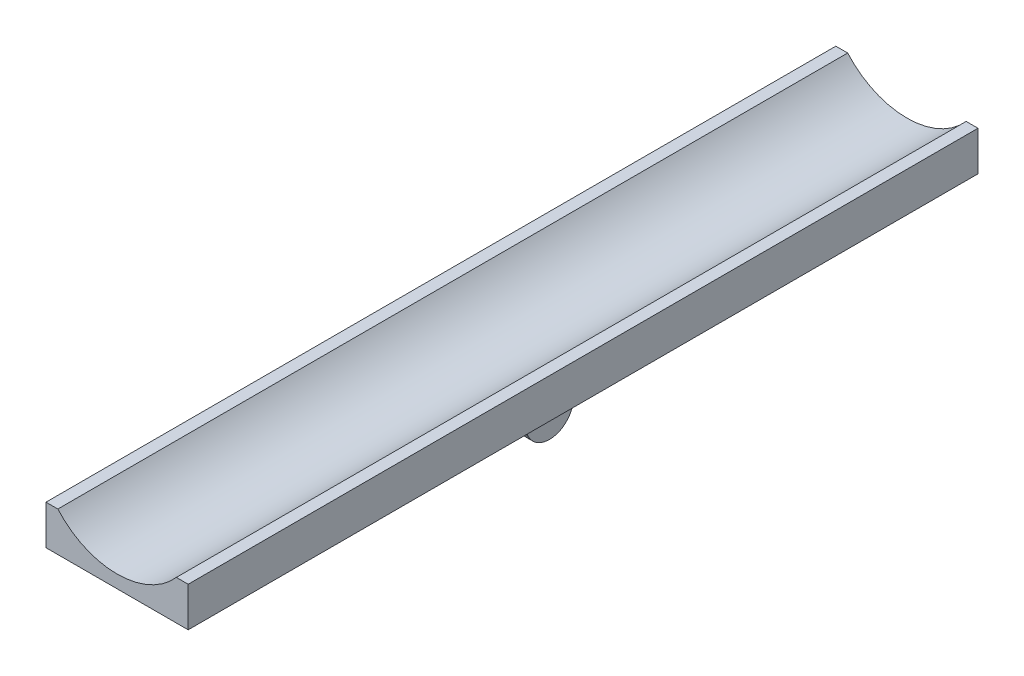
ISO-10303-21;
HEADER;
FILE_DESCRIPTION(('STEP AP214'),'2;1');
FILE_NAME('part.step','',(''),(''),'','','');
FILE_SCHEMA(('AUTOMOTIVE_DESIGN { 1 0 10303 214 1 1 1 1 }'));
ENDSEC;
DATA;
#1=APPLICATION_CONTEXT('core data for automotive mechanical design processes');
#2=APPLICATION_PROTOCOL_DEFINITION('international standard','automotive_design',2000,#1);
#3=PRODUCT_CONTEXT('',#1,'mechanical');
#4=PRODUCT('Part','Part','',(#3));
#5=PRODUCT_RELATED_PRODUCT_CATEGORY('part','',(#4));
#6=PRODUCT_DEFINITION_FORMATION('','',#4);
#7=PRODUCT_DEFINITION_CONTEXT('part definition',#1,'design');
#8=PRODUCT_DEFINITION('design','',#6,#7);
#9=PRODUCT_DEFINITION_SHAPE('','',#8);
#10=(LENGTH_UNIT() NAMED_UNIT(*) SI_UNIT(.MILLI.,.METRE.));
#11=(NAMED_UNIT(*) PLANE_ANGLE_UNIT() SI_UNIT($,.RADIAN.));
#12=(NAMED_UNIT(*) SI_UNIT($,.STERADIAN.) SOLID_ANGLE_UNIT());
#13=UNCERTAINTY_MEASURE_WITH_UNIT(LENGTH_MEASURE(1.E-05),#10,'distance_accuracy_value','');
#14=(GEOMETRIC_REPRESENTATION_CONTEXT(3) GLOBAL_UNCERTAINTY_ASSIGNED_CONTEXT((#13)) GLOBAL_UNIT_ASSIGNED_CONTEXT((#10,
#11,#12)) REPRESENTATION_CONTEXT('',''));
#15=CARTESIAN_POINT('',(0.,0.,0.));
#16=DIRECTION('',(0.,0.,1.));
#17=DIRECTION('',(1.,0.,0.));
#18=AXIS2_PLACEMENT_3D('',#15,#16,#17);
#19=CARTESIAN_POINT('',(0.,6.5,0.));
#20=DIRECTION('',(0.,-1.,0.));
#21=DIRECTION('',(0.,0.,-1.));
#22=AXIS2_PLACEMENT_3D('',#19,#20,#21);
#23=PLANE('',#22);
#24=DIRECTION('',(-1.,0.,0.));
#25=VECTOR('',#24,1.);
#26=CARTESIAN_POINT('',(-9.7,6.5,3.2));
#27=LINE('',#26,#25);
#28=CARTESIAN_POINT('',(9.7,6.5,3.2));
#29=VERTEX_POINT('',#28);
#30=CARTESIAN_POINT('',(-9.7,6.5,3.2));
#31=VERTEX_POINT('',#30);
#32=EDGE_CURVE('E76',#29,#31,#27,.T.);
#33=ORIENTED_EDGE('',*,*,#32,.F.);
#34=DIRECTION('',(0.,0.,1.));
#35=VECTOR('',#34,1.);
#36=CARTESIAN_POINT('',(9.7,6.5,3.2));
#37=LINE('',#36,#35);
#38=CARTESIAN_POINT('',(9.7,6.5,-3.2));
#39=VERTEX_POINT('',#38);
#40=EDGE_CURVE('E185',#39,#29,#37,.T.);
#41=ORIENTED_EDGE('',*,*,#40,.F.);
#42=DIRECTION('',(1.,0.,0.));
#43=VECTOR('',#42,1.);
#44=CARTESIAN_POINT('',(-9.7,6.5,-3.2));
#45=LINE('',#44,#43);
#46=CARTESIAN_POINT('',(-9.7,6.5,-3.2));
#47=VERTEX_POINT('',#46);
#48=EDGE_CURVE('E189',#47,#39,#45,.T.);
#49=ORIENTED_EDGE('',*,*,#48,.F.);
#50=DIRECTION('',(0.,0.,-1.));
#51=VECTOR('',#50,1.);
#52=CARTESIAN_POINT('',(-9.7,6.5,3.2));
#53=LINE('',#52,#51);
#54=EDGE_CURVE('E198',#31,#47,#53,.T.);
#55=ORIENTED_EDGE('',*,*,#54,.F.);
#56=EDGE_LOOP('',(#33,#41,#49,#55));
#57=FACE_BOUND('',#56,.T.);
#58=DIRECTION('',(0.,0.,1.));
#59=VECTOR('',#58,1.);
#60=CARTESIAN_POINT('',(3.2,6.5,-89.3));
#61=LINE('',#60,#59);
#62=CARTESIAN_POINT('',(3.2,6.5,-95.7));
#63=VERTEX_POINT('',#62);
#64=CARTESIAN_POINT('',(3.2,6.5,-89.3));
#65=VERTEX_POINT('',#64);
#66=EDGE_CURVE('E84',#63,#65,#61,.T.);
#67=ORIENTED_EDGE('',*,*,#66,.F.);
#68=DIRECTION('',(1.,0.,0.));
#69=VECTOR('',#68,1.);
#70=CARTESIAN_POINT('',(3.2,6.5,-95.7));
#71=LINE('',#70,#69);
#72=CARTESIAN_POINT('',(-3.2,6.5,-95.7));
#73=VERTEX_POINT('',#72);
#74=EDGE_CURVE('E226',#73,#63,#71,.T.);
#75=ORIENTED_EDGE('',*,*,#74,.F.);
#76=DIRECTION('',(0.,0.,-1.));
#77=VECTOR('',#76,1.);
#78=CARTESIAN_POINT('',(-3.2,6.5,-89.3));
#79=LINE('',#78,#77);
#80=CARTESIAN_POINT('',(-3.2,6.5,-89.3));
#81=VERTEX_POINT('',#80);
#82=EDGE_CURVE('E230',#81,#73,#79,.T.);
#83=ORIENTED_EDGE('',*,*,#82,.F.);
#84=DIRECTION('',(-1.,0.,0.));
#85=VECTOR('',#84,1.);
#86=CARTESIAN_POINT('',(3.2,6.5,-89.3));
#87=LINE('',#86,#85);
#88=EDGE_CURVE('E235',#65,#81,#87,.T.);
#89=ORIENTED_EDGE('',*,*,#88,.F.);
#90=EDGE_LOOP('',(#67,#75,#83,#89));
#91=FACE_BOUND('',#90,.T.);
#92=DIRECTION('',(0.,0.,-1.));
#93=VECTOR('',#92,1.);
#94=CARTESIAN_POINT('',(-18.,6.5,92.5));
#95=LINE('',#94,#93);
#96=CARTESIAN_POINT('',(-18.,6.5,100.));
#97=VERTEX_POINT('',#96);
#98=CARTESIAN_POINT('',(-18.,6.5,-100.));
#99=VERTEX_POINT('',#98);
#100=EDGE_CURVE('E267',#97,#99,#95,.T.);
#101=ORIENTED_EDGE('',*,*,#100,.T.);
#102=DIRECTION('',(-1.,0.,0.));
#103=VECTOR('',#102,1.);
#104=CARTESIAN_POINT('',(18.,6.5,-100.));
#105=LINE('',#104,#103);
#106=CARTESIAN_POINT('',(18.,6.5,-100.));
#107=VERTEX_POINT('',#106);
#108=EDGE_CURVE('E288',#107,#99,#105,.T.);
#109=ORIENTED_EDGE('',*,*,#108,.F.);
#110=DIRECTION('',(0.,0.,-1.));
#111=VECTOR('',#110,1.);
#112=CARTESIAN_POINT('',(18.,6.5,92.5));
#113=LINE('',#112,#111);
#114=CARTESIAN_POINT('',(18.,6.5,100.));
#115=VERTEX_POINT('',#114);
#116=EDGE_CURVE('E264',#115,#107,#113,.T.);
#117=ORIENTED_EDGE('',*,*,#116,.F.);
#118=DIRECTION('',(1.,0.,0.));
#119=VECTOR('',#118,1.);
#120=CARTESIAN_POINT('',(-18.,6.5,100.));
#121=LINE('',#120,#119);
#122=EDGE_CURVE('E69',#97,#115,#121,.T.);
#123=ORIENTED_EDGE('',*,*,#122,.F.);
#124=EDGE_LOOP('',(#101,#109,#117,#123));
#125=FACE_BOUND('',#124,.T.);
#126=ADVANCED_FACE('F61',(#57,#91,#125),#23,.T.);
#127=CARTESIAN_POINT('',(15.,16.5,0.));
#128=DIRECTION('',(0.,1.,0.));
#129=DIRECTION('',(0.,0.,-1.));
#130=AXIS2_PLACEMENT_3D('',#127,#128,#129);
#131=PLANE('',#130);
#132=DIRECTION('',(0.,0.,-1.));
#133=VECTOR('',#132,1.);
#134=CARTESIAN_POINT('',(15.,16.5,0.));
#135=LINE('',#134,#133);
#136=CARTESIAN_POINT('',(15.,16.5,100.));
#137=VERTEX_POINT('',#136);
#138=CARTESIAN_POINT('',(15.,16.5,-100.));
#139=VERTEX_POINT('',#138);
#140=EDGE_CURVE('E207',#137,#139,#135,.T.);
#141=ORIENTED_EDGE('',*,*,#140,.F.);
#142=DIRECTION('',(-1.,0.,0.));
#143=VECTOR('',#142,1.);
#144=CARTESIAN_POINT('',(18.,16.5,100.));
#145=LINE('',#144,#143);
#146=CARTESIAN_POINT('',(18.,16.5,100.));
#147=VERTEX_POINT('',#146);
#148=EDGE_CURVE('E304',#147,#137,#145,.T.);
#149=ORIENTED_EDGE('',*,*,#148,.F.);
#150=DIRECTION('',(0.,0.,1.));
#151=VECTOR('',#150,1.);
#152=CARTESIAN_POINT('',(18.,16.5,0.));
#153=LINE('',#152,#151);
#154=CARTESIAN_POINT('',(18.,16.5,-100.));
#155=VERTEX_POINT('',#154);
#156=EDGE_CURVE('E255',#147,#155,#153,.F.);
#157=ORIENTED_EDGE('',*,*,#156,.T.);
#158=DIRECTION('',(1.,0.,0.));
#159=VECTOR('',#158,1.);
#160=CARTESIAN_POINT('',(15.,16.5,-100.));
#161=LINE('',#160,#159);
#162=EDGE_CURVE('E270',#139,#155,#161,.T.);
#163=ORIENTED_EDGE('',*,*,#162,.F.);
#164=EDGE_LOOP('',(#141,#149,#157,#163));
#165=FACE_BOUND('',#164,.T.);
#166=ADVANCED_FACE('F326',(#165),#131,.T.);
#167=CARTESIAN_POINT('',(18.,-1.5,0.));
#168=DIRECTION('',(-1.,0.,0.));
#169=DIRECTION('',(0.,0.,1.));
#170=AXIS2_PLACEMENT_3D('',#167,#168,#169);
#171=PLANE('',#170);
#172=ORIENTED_EDGE('',*,*,#156,.F.);
#173=DIRECTION('',(0.,1.,0.));
#174=VECTOR('',#173,1.);
#175=CARTESIAN_POINT('',(18.,6.5,100.));
#176=LINE('',#175,#174);
#177=EDGE_CURVE('E308',#115,#147,#176,.T.);
#178=ORIENTED_EDGE('',*,*,#177,.F.);
#179=ORIENTED_EDGE('',*,*,#116,.T.);
#180=DIRECTION('',(0.,-1.,0.));
#181=VECTOR('',#180,1.);
#182=CARTESIAN_POINT('',(18.,16.5,-100.));
#183=LINE('',#182,#181);
#184=EDGE_CURVE('E292',#155,#107,#183,.T.);
#185=ORIENTED_EDGE('',*,*,#184,.F.);
#186=EDGE_LOOP('',(#172,#178,#179,#185));
#187=FACE_BOUND('',#186,.T.);
#188=ADVANCED_FACE('F321',(#187),#171,.F.);
#189=CARTESIAN_POINT('',(-15.,16.5,0.));
#190=DIRECTION('',(0.,1.,0.));
#191=DIRECTION('',(0.,0.,-1.));
#192=AXIS2_PLACEMENT_3D('',#189,#190,#191);
#193=PLANE('',#192);
#194=DIRECTION('',(0.,0.,1.));
#195=VECTOR('',#194,1.);
#196=CARTESIAN_POINT('',(-18.,16.5,0.));
#197=LINE('',#196,#195);
#198=CARTESIAN_POINT('',(-18.,16.5,100.));
#199=VERTEX_POINT('',#198);
#200=CARTESIAN_POINT('',(-18.,16.5,-100.));
#201=VERTEX_POINT('',#200);
#202=EDGE_CURVE('E258',#199,#201,#197,.F.);
#203=ORIENTED_EDGE('',*,*,#202,.F.);
#204=DIRECTION('',(-1.,0.,0.));
#205=VECTOR('',#204,1.);
#206=CARTESIAN_POINT('',(-15.,16.5,100.));
#207=LINE('',#206,#205);
#208=CARTESIAN_POINT('',(-15.,16.5,100.));
#209=VERTEX_POINT('',#208);
#210=EDGE_CURVE('E296',#209,#199,#207,.T.);
#211=ORIENTED_EDGE('',*,*,#210,.F.);
#212=DIRECTION('',(0.,0.,-1.));
#213=VECTOR('',#212,1.);
#214=CARTESIAN_POINT('',(-15.,16.5,0.));
#215=LINE('',#214,#213);
#216=CARTESIAN_POINT('',(-15.,16.5,-100.));
#217=VERTEX_POINT('',#216);
#218=EDGE_CURVE('E261',#209,#217,#215,.T.);
#219=ORIENTED_EDGE('',*,*,#218,.T.);
#220=DIRECTION('',(1.,0.,0.));
#221=VECTOR('',#220,1.);
#222=CARTESIAN_POINT('',(-18.,16.5,-100.));
#223=LINE('',#222,#221);
#224=EDGE_CURVE('E280',#201,#217,#223,.T.);
#225=ORIENTED_EDGE('',*,*,#224,.F.);
#226=EDGE_LOOP('',(#203,#211,#219,#225));
#227=FACE_BOUND('',#226,.T.);
#228=ADVANCED_FACE('F336',(#227),#193,.T.);
#229=CARTESIAN_POINT('',(-18.,-1.5,0.));
#230=DIRECTION('',(-1.,0.,0.));
#231=DIRECTION('',(0.,0.,1.));
#232=AXIS2_PLACEMENT_3D('',#229,#230,#231);
#233=PLANE('',#232);
#234=ORIENTED_EDGE('',*,*,#100,.F.);
#235=DIRECTION('',(0.,-1.,0.));
#236=VECTOR('',#235,1.);
#237=CARTESIAN_POINT('',(-18.,16.5,100.));
#238=LINE('',#237,#236);
#239=EDGE_CURVE('E12',#199,#97,#238,.T.);
#240=ORIENTED_EDGE('',*,*,#239,.F.);
#241=ORIENTED_EDGE('',*,*,#202,.T.);
#242=DIRECTION('',(0.,1.,0.));
#243=VECTOR('',#242,1.);
#244=CARTESIAN_POINT('',(-18.,6.5,-100.));
#245=LINE('',#244,#243);
#246=EDGE_CURVE('E284',#99,#201,#245,.T.);
#247=ORIENTED_EDGE('',*,*,#246,.F.);
#248=EDGE_LOOP('',(#234,#240,#241,#247));
#249=FACE_BOUND('',#248,.T.);
#250=ADVANCED_FACE('F339',(#249),#233,.T.);
#251=CARTESIAN_POINT('',(0.,29.7287565553229,-92.5));
#252=DIRECTION('',(0.,0.,1.));
#253=DIRECTION('',(1.,0.,0.));
#254=AXIS2_PLACEMENT_3D('',#251,#252,#253);
#255=CYLINDRICAL_SURFACE('',#254,19.9999999999999);
#256=ORIENTED_EDGE('',*,*,#218,.F.);
#257=CARTESIAN_POINT('',(0.,29.7287565553229,100.));
#258=DIRECTION('',(0.,0.,-1.));
#259=DIRECTION('',(1.,0.,0.));
#260=AXIS2_PLACEMENT_3D('',#257,#258,#259);
#261=CIRCLE('',#260,19.9999999999999);
#262=EDGE_CURVE('E300',#137,#209,#261,.T.);
#263=ORIENTED_EDGE('',*,*,#262,.F.);
#264=ORIENTED_EDGE('',*,*,#140,.T.);
#265=CARTESIAN_POINT('',(0.,29.7287565553229,-100.));
#266=DIRECTION('',(0.,0.,1.));
#267=DIRECTION('',(-1.,0.,0.));
#268=AXIS2_PLACEMENT_3D('',#265,#266,#267);
#269=CIRCLE('',#268,19.9999999999999);
#270=EDGE_CURVE('E276',#217,#139,#269,.T.);
#271=ORIENTED_EDGE('',*,*,#270,.F.);
#272=EDGE_LOOP('',(#256,#263,#264,#271));
#273=FACE_BOUND('',#272,.T.);
#274=ADVANCED_FACE('F332',(#273),#255,.F.);
#275=CARTESIAN_POINT('',(0.,29.7287565553229,-100.));
#276=DIRECTION('',(0.,0.,-1.));
#277=DIRECTION('',(-1.,0.,0.));
#278=AXIS2_PLACEMENT_3D('',#275,#276,#277);
#279=PLANE('',#278);
#280=ORIENTED_EDGE('',*,*,#184,.T.);
#281=ORIENTED_EDGE('',*,*,#108,.T.);
#282=ORIENTED_EDGE('',*,*,#246,.T.);
#283=ORIENTED_EDGE('',*,*,#224,.T.);
#284=ORIENTED_EDGE('',*,*,#270,.T.);
#285=ORIENTED_EDGE('',*,*,#162,.T.);
#286=EDGE_LOOP('',(#280,#281,#282,#283,#284,#285));
#287=FACE_BOUND('',#286,.T.);
#288=ADVANCED_FACE('F328',(#287),#279,.T.);
#289=CARTESIAN_POINT('',(0.,29.7287565553229,100.));
#290=DIRECTION('',(0.,0.,1.));
#291=DIRECTION('',(1.,0.,0.));
#292=AXIS2_PLACEMENT_3D('',#289,#290,#291);
#293=PLANE('',#292);
#294=ORIENTED_EDGE('',*,*,#239,.T.);
#295=ORIENTED_EDGE('',*,*,#122,.T.);
#296=ORIENTED_EDGE('',*,*,#177,.T.);
#297=ORIENTED_EDGE('',*,*,#148,.T.);
#298=ORIENTED_EDGE('',*,*,#262,.T.);
#299=ORIENTED_EDGE('',*,*,#210,.T.);
#300=EDGE_LOOP('',(#294,#295,#296,#297,#298,#299));
#301=FACE_BOUND('',#300,.T.);
#302=ADVANCED_FACE('F316',(#301),#293,.T.);
#303=CARTESIAN_POINT('',(3.2,8.5,-89.3));
#304=DIRECTION('',(1.,0.,0.));
#305=DIRECTION('',(0.,0.,-1.));
#306=AXIS2_PLACEMENT_3D('',#303,#304,#305);
#307=PLANE('',#306);
#308=ORIENTED_EDGE('',*,*,#66,.T.);
#309=DIRECTION('',(0.,-1.,0.));
#310=VECTOR('',#309,1.);
#311=CARTESIAN_POINT('',(3.2,8.5,-89.3));
#312=LINE('',#311,#310);
#313=CARTESIAN_POINT('',(3.2,8.5,-89.3));
#314=VERTEX_POINT('',#313);
#315=EDGE_CURVE('E213',#314,#65,#312,.T.);
#316=ORIENTED_EDGE('',*,*,#315,.F.);
#317=DIRECTION('',(0.,0.,1.));
#318=VECTOR('',#317,1.);
#319=CARTESIAN_POINT('',(3.2,8.5,-89.3));
#320=LINE('',#319,#318);
#321=CARTESIAN_POINT('',(3.2,8.5,-95.7));
#322=VERTEX_POINT('',#321);
#323=EDGE_CURVE('E231',#322,#314,#320,.T.);
#324=ORIENTED_EDGE('',*,*,#323,.F.);
#325=DIRECTION('',(0.,-1.,0.));
#326=VECTOR('',#325,1.);
#327=CARTESIAN_POINT('',(3.2,8.5,-95.7));
#328=LINE('',#327,#326);
#329=EDGE_CURVE('E223',#322,#63,#328,.T.);
#330=ORIENTED_EDGE('',*,*,#329,.T.);
#331=EDGE_LOOP('',(#308,#316,#324,#330));
#332=FACE_BOUND('',#331,.T.);
#333=ADVANCED_FACE('F342',(#332),#307,.F.);
#334=CARTESIAN_POINT('',(3.2,8.5,-95.7));
#335=DIRECTION('',(0.,0.,-1.));
#336=DIRECTION('',(-1.,0.,0.));
#337=AXIS2_PLACEMENT_3D('',#334,#335,#336);
#338=PLANE('',#337);
#339=ORIENTED_EDGE('',*,*,#74,.T.);
#340=ORIENTED_EDGE('',*,*,#329,.F.);
#341=DIRECTION('',(1.,0.,0.));
#342=VECTOR('',#341,1.);
#343=CARTESIAN_POINT('',(3.2,8.5,-95.7));
#344=LINE('',#343,#342);
#345=CARTESIAN_POINT('',(-3.2,8.5,-95.7));
#346=VERTEX_POINT('',#345);
#347=EDGE_CURVE('E216',#346,#322,#344,.T.);
#348=ORIENTED_EDGE('',*,*,#347,.F.);
#349=DIRECTION('',(0.,-1.,0.));
#350=VECTOR('',#349,1.);
#351=CARTESIAN_POINT('',(-3.2,8.5,-95.7));
#352=LINE('',#351,#350);
#353=EDGE_CURVE('E220',#346,#73,#352,.T.);
#354=ORIENTED_EDGE('',*,*,#353,.T.);
#355=EDGE_LOOP('',(#339,#340,#348,#354));
#356=FACE_BOUND('',#355,.T.);
#357=ADVANCED_FACE('F350',(#356),#338,.F.);
#358=CARTESIAN_POINT('',(-3.2,8.5,-89.3));
#359=DIRECTION('',(-1.,0.,0.));
#360=DIRECTION('',(0.,0.,1.));
#361=AXIS2_PLACEMENT_3D('',#358,#359,#360);
#362=PLANE('',#361);
#363=ORIENTED_EDGE('',*,*,#82,.T.);
#364=ORIENTED_EDGE('',*,*,#353,.F.);
#365=DIRECTION('',(0.,0.,-1.));
#366=VECTOR('',#365,1.);
#367=CARTESIAN_POINT('',(-3.2,8.5,-89.3));
#368=LINE('',#367,#366);
#369=CARTESIAN_POINT('',(-3.2,8.5,-89.3));
#370=VERTEX_POINT('',#369);
#371=EDGE_CURVE('E244',#370,#346,#368,.T.);
#372=ORIENTED_EDGE('',*,*,#371,.F.);
#373=DIRECTION('',(0.,-1.,0.));
#374=VECTOR('',#373,1.);
#375=CARTESIAN_POINT('',(-3.2,8.5,-89.3));
#376=LINE('',#375,#374);
#377=EDGE_CURVE('E217',#370,#81,#376,.T.);
#378=ORIENTED_EDGE('',*,*,#377,.T.);
#379=EDGE_LOOP('',(#363,#364,#372,#378));
#380=FACE_BOUND('',#379,.T.);
#381=ADVANCED_FACE('F372',(#380),#362,.F.);
#382=CARTESIAN_POINT('',(3.2,8.5,-89.3));
#383=DIRECTION('',(0.,0.,1.));
#384=DIRECTION('',(1.,0.,0.));
#385=AXIS2_PLACEMENT_3D('',#382,#383,#384);
#386=PLANE('',#385);
#387=ORIENTED_EDGE('',*,*,#88,.T.);
#388=ORIENTED_EDGE('',*,*,#377,.F.);
#389=DIRECTION('',(-1.,0.,0.));
#390=VECTOR('',#389,1.);
#391=CARTESIAN_POINT('',(3.2,8.5,-89.3));
#392=LINE('',#391,#390);
#393=EDGE_CURVE('E248',#314,#370,#392,.T.);
#394=ORIENTED_EDGE('',*,*,#393,.F.);
#395=ORIENTED_EDGE('',*,*,#315,.T.);
#396=EDGE_LOOP('',(#387,#388,#394,#395));
#397=FACE_BOUND('',#396,.T.);
#398=ADVANCED_FACE('F368',(#397),#386,.F.);
#399=CARTESIAN_POINT('',(0.,8.5,0.));
#400=DIRECTION('',(0.,1.,0.));
#401=DIRECTION('',(0.,0.,1.));
#402=AXIS2_PLACEMENT_3D('',#399,#400,#401);
#403=PLANE('',#402);
#404=ORIENTED_EDGE('',*,*,#323,.T.);
#405=ORIENTED_EDGE('',*,*,#393,.T.);
#406=ORIENTED_EDGE('',*,*,#371,.T.);
#407=ORIENTED_EDGE('',*,*,#347,.T.);
#408=EDGE_LOOP('',(#404,#405,#406,#407));
#409=FACE_BOUND('',#408,.T.);
#410=ADVANCED_FACE('F365',(#409),#403,.F.);
#411=CARTESIAN_POINT('',(-9.7,8.5,3.2));
#412=DIRECTION('',(0.,0.,1.));
#413=DIRECTION('',(1.,0.,0.));
#414=AXIS2_PLACEMENT_3D('',#411,#412,#413);
#415=PLANE('',#414);
#416=ORIENTED_EDGE('',*,*,#32,.T.);
#417=DIRECTION('',(0.,-1.,0.));
#418=VECTOR('',#417,1.);
#419=CARTESIAN_POINT('',(-9.7,8.5,3.2));
#420=LINE('',#419,#418);
#421=CARTESIAN_POINT('',(-9.7,8.5,3.2));
#422=VERTEX_POINT('',#421);
#423=EDGE_CURVE('E160',#422,#31,#420,.T.);
#424=ORIENTED_EDGE('',*,*,#423,.F.);
#425=DIRECTION('',(-1.,0.,0.));
#426=VECTOR('',#425,1.);
#427=CARTESIAN_POINT('',(-9.7,8.5,3.2));
#428=LINE('',#427,#426);
#429=CARTESIAN_POINT('',(9.7,8.5,3.2));
#430=VERTEX_POINT('',#429);
#431=EDGE_CURVE('E164',#430,#422,#428,.T.);
#432=ORIENTED_EDGE('',*,*,#431,.F.);
#433=DIRECTION('',(0.,-1.,0.));
#434=VECTOR('',#433,1.);
#435=CARTESIAN_POINT('',(9.7,8.5,3.2));
#436=LINE('',#435,#434);
#437=EDGE_CURVE('E204',#430,#29,#436,.T.);
#438=ORIENTED_EDGE('',*,*,#437,.T.);
#439=EDGE_LOOP('',(#416,#424,#432,#438));
#440=FACE_BOUND('',#439,.T.);
#441=ADVANCED_FACE('F162',(#440),#415,.F.);
#442=CARTESIAN_POINT('',(9.7,8.5,3.2));
#443=DIRECTION('',(1.,0.,0.));
#444=DIRECTION('',(0.,0.,-1.));
#445=AXIS2_PLACEMENT_3D('',#442,#443,#444);
#446=PLANE('',#445);
#447=ORIENTED_EDGE('',*,*,#40,.T.);
#448=ORIENTED_EDGE('',*,*,#437,.F.);
#449=DIRECTION('',(0.,0.,1.));
#450=VECTOR('',#449,1.);
#451=CARTESIAN_POINT('',(9.7,8.5,3.2));
#452=LINE('',#451,#450);
#453=CARTESIAN_POINT('',(9.7,8.5,-3.2));
#454=VERTEX_POINT('',#453);
#455=EDGE_CURVE('E171',#454,#430,#452,.T.);
#456=ORIENTED_EDGE('',*,*,#455,.F.);
#457=DIRECTION('',(0.,-1.,0.));
#458=VECTOR('',#457,1.);
#459=CARTESIAN_POINT('',(9.7,8.5,-3.2));
#460=LINE('',#459,#458);
#461=EDGE_CURVE('E208',#454,#39,#460,.T.);
#462=ORIENTED_EDGE('',*,*,#461,.T.);
#463=EDGE_LOOP('',(#447,#448,#456,#462));
#464=FACE_BOUND('',#463,.T.);
#465=ADVANCED_FACE('F382',(#464),#446,.F.);
#466=CARTESIAN_POINT('',(-9.7,8.5,-3.2));
#467=DIRECTION('',(0.,0.,-1.));
#468=DIRECTION('',(-1.,0.,0.));
#469=AXIS2_PLACEMENT_3D('',#466,#467,#468);
#470=PLANE('',#469);
#471=ORIENTED_EDGE('',*,*,#48,.T.);
#472=ORIENTED_EDGE('',*,*,#461,.F.);
#473=DIRECTION('',(1.,0.,0.));
#474=VECTOR('',#473,1.);
#475=CARTESIAN_POINT('',(-9.7,8.5,-3.2));
#476=LINE('',#475,#474);
#477=CARTESIAN_POINT('',(-9.7,8.5,-3.2));
#478=VERTEX_POINT('',#477);
#479=EDGE_CURVE('E180',#478,#454,#476,.T.);
#480=ORIENTED_EDGE('',*,*,#479,.F.);
#481=DIRECTION('',(0.,-1.,0.));
#482=VECTOR('',#481,1.);
#483=CARTESIAN_POINT('',(-9.7,8.5,-3.2));
#484=LINE('',#483,#482);
#485=EDGE_CURVE('E170',#478,#47,#484,.T.);
#486=ORIENTED_EDGE('',*,*,#485,.T.);
#487=EDGE_LOOP('',(#471,#472,#480,#486));
#488=FACE_BOUND('',#487,.T.);
#489=ADVANCED_FACE('F385',(#488),#470,.F.);
#490=CARTESIAN_POINT('',(-9.7,8.5,3.2));
#491=DIRECTION('',(-1.,0.,0.));
#492=DIRECTION('',(0.,0.,1.));
#493=AXIS2_PLACEMENT_3D('',#490,#491,#492);
#494=PLANE('',#493);
#495=ORIENTED_EDGE('',*,*,#54,.T.);
#496=ORIENTED_EDGE('',*,*,#485,.F.);
#497=DIRECTION('',(0.,0.,-1.));
#498=VECTOR('',#497,1.);
#499=CARTESIAN_POINT('',(-9.7,8.5,3.2));
#500=LINE('',#499,#498);
#501=EDGE_CURVE('E174',#422,#478,#500,.T.);
#502=ORIENTED_EDGE('',*,*,#501,.F.);
#503=ORIENTED_EDGE('',*,*,#423,.T.);
#504=EDGE_LOOP('',(#495,#496,#502,#503));
#505=FACE_BOUND('',#504,.T.);
#506=ADVANCED_FACE('F175',(#505),#494,.F.);
#507=CARTESIAN_POINT('',(0.,8.5,0.));
#508=DIRECTION('',(0.,1.,0.));
#509=DIRECTION('',(0.,0.,1.));
#510=AXIS2_PLACEMENT_3D('',#507,#508,#509);
#511=PLANE('',#510);
#512=ORIENTED_EDGE('',*,*,#431,.T.);
#513=ORIENTED_EDGE('',*,*,#501,.T.);
#514=ORIENTED_EDGE('',*,*,#479,.T.);
#515=ORIENTED_EDGE('',*,*,#455,.T.);
#516=EDGE_LOOP('',(#512,#513,#514,#515));
#517=FACE_BOUND('',#516,.T.);
#518=ADVANCED_FACE('F182',(#517),#511,.F.);
#519=CLOSED_SHELL('',(#126,#166,#188,#228,#250,#274,#288,#302,#333,#357,#381,#398,#410,#441,
#465,#489,#506,#518));
#520=MANIFOLD_SOLID_BREP('B2',#519);
#521=CARTESIAN_POINT('',(0.,6.5,0.));
#522=DIRECTION('',(0.,-1.,0.));
#523=DIRECTION('',(0.,0.,-1.));
#524=AXIS2_PLACEMENT_3D('',#521,#522,#523);
#525=PLANE('',#524);
#526=DIRECTION('',(1.,0.,0.));
#527=VECTOR('',#526,1.);
#528=CARTESIAN_POINT('',(-9.5,6.5,3.));
#529=LINE('',#528,#527);
#530=CARTESIAN_POINT('',(-9.5,6.5,3.));
#531=VERTEX_POINT('',#530);
#532=CARTESIAN_POINT('',(9.5,6.5,3.));
#533=VERTEX_POINT('',#532);
#534=EDGE_CURVE('E577',#531,#533,#529,.T.);
#535=ORIENTED_EDGE('',*,*,#534,.F.);
#536=DIRECTION('',(0.,0.,-1.));
#537=VECTOR('',#536,1.);
#538=CARTESIAN_POINT('',(-9.5,6.5,0.));
#539=LINE('',#538,#537);
#540=CARTESIAN_POINT('',(-9.5,6.5,10.));
#541=VERTEX_POINT('',#540);
#542=EDGE_CURVE('E633',#541,#531,#539,.T.);
#543=ORIENTED_EDGE('',*,*,#542,.F.);
#544=DIRECTION('',(1.,0.,0.));
#545=VECTOR('',#544,1.);
#546=CARTESIAN_POINT('',(-33.0849528301415,6.5,10.));
#547=LINE('',#546,#545);
#548=CARTESIAN_POINT('',(9.5,6.5,10.));
#549=VERTEX_POINT('',#548);
#550=EDGE_CURVE('E693',#541,#549,#547,.T.);
#551=ORIENTED_EDGE('',*,*,#550,.T.);
#552=DIRECTION('',(0.,0.,-1.));
#553=VECTOR('',#552,1.);
#554=CARTESIAN_POINT('',(9.5,6.5,0.));
#555=LINE('',#554,#553);
#556=EDGE_CURVE('E563',#549,#533,#555,.T.);
#557=ORIENTED_EDGE('',*,*,#556,.T.);
#558=EDGE_LOOP('',(#535,#543,#551,#557));
#559=FACE_BOUND('',#558,.T.);
#560=ADVANCED_FACE('F560',(#559),#525,.F.);
#561=DIRECTION('',(-1.,0.,0.));
#562=VECTOR('',#561,1.);
#563=CARTESIAN_POINT('',(-9.5,6.5,-3.));
#564=LINE('',#563,#562);
#565=CARTESIAN_POINT('',(9.5,6.5,-3.));
#566=VERTEX_POINT('',#565);
#567=CARTESIAN_POINT('',(-9.5,6.5,-3.));
#568=VERTEX_POINT('',#567);
#569=EDGE_CURVE('E585',#566,#568,#564,.T.);
#570=ORIENTED_EDGE('',*,*,#569,.F.);
#571=CARTESIAN_POINT('',(9.5,6.5,-9.99999999999999));
#572=VERTEX_POINT('',#571);
#573=EDGE_CURVE('E665',#566,#572,#555,.T.);
#574=ORIENTED_EDGE('',*,*,#573,.T.);
#575=DIRECTION('',(1.,0.,0.));
#576=VECTOR('',#575,1.);
#577=CARTESIAN_POINT('',(-33.0849528301415,6.5,-10.));
#578=LINE('',#577,#576);
#579=CARTESIAN_POINT('',(-9.5,6.5,-10.));
#580=VERTEX_POINT('',#579);
#581=EDGE_CURVE('E628',#580,#572,#578,.T.);
#582=ORIENTED_EDGE('',*,*,#581,.F.);
#583=EDGE_CURVE('E625',#568,#580,#539,.T.);
#584=ORIENTED_EDGE('',*,*,#583,.F.);
#585=EDGE_LOOP('',(#570,#574,#582,#584));
#586=FACE_BOUND('',#585,.T.);
#587=ADVANCED_FACE('F626',(#586),#525,.F.);
#588=CARTESIAN_POINT('',(-33.0849528301415,-2.70274758413108,-5.3567859296856));
#589=DIRECTION('',(0.,-0.450457930688488,-0.892797654947551));
#590=DIRECTION('',(0.,0.892797654947551,-0.450457930688488));
#591=AXIS2_PLACEMENT_3D('',#588,#589,#590);
#592=PLANE('',#591);
#593=DIRECTION('',(1.,0.,0.));
#594=VECTOR('',#593,1.);
#595=CARTESIAN_POINT('',(-33.0849528301415,-2.70274758413071,-5.3567859296856));
#596=LINE('',#595,#594);
#597=CARTESIAN_POINT('',(-9.5,-2.70274758413079,-5.35678592968575));
#598=VERTEX_POINT('',#597);
#599=CARTESIAN_POINT('',(9.5,-2.70274758413079,-5.35678592968575));
#600=VERTEX_POINT('',#599);
#601=EDGE_CURVE('E682',#598,#600,#596,.T.);
#602=ORIENTED_EDGE('',*,*,#601,.F.);
#603=DIRECTION('',(0.,0.892797654947551,-0.450457930688488));
#604=VECTOR('',#603,1.);
#605=CARTESIAN_POINT('',(-9.5,-2.70274758413108,-5.3567859296856));
#606=LINE('',#605,#604);
#607=EDGE_CURVE('E677',#598,#580,#606,.T.);
#608=ORIENTED_EDGE('',*,*,#607,.T.);
#609=ORIENTED_EDGE('',*,*,#581,.T.);
#610=DIRECTION('',(0.,0.892797654947551,-0.450457930688488));
#611=VECTOR('',#610,1.);
#612=CARTESIAN_POINT('',(9.5,-2.70274758413108,-5.3567859296856));
#613=LINE('',#612,#611);
#614=EDGE_CURVE('E59',#600,#572,#613,.T.);
#615=ORIENTED_EDGE('',*,*,#614,.F.);
#616=EDGE_LOOP('',(#602,#608,#609,#615));
#617=FACE_BOUND('',#616,.T.);
#618=ADVANCED_FACE('F721',(#617),#592,.T.);
#619=CARTESIAN_POINT('',(-33.0849528301415,0.,0.));
#620=DIRECTION('',(1.,0.,0.));
#621=DIRECTION('',(0.,0.,-1.));
#622=AXIS2_PLACEMENT_3D('',#619,#620,#621);
#623=CYLINDRICAL_SURFACE('',#622,6.);
#624=DIRECTION('',(1.,0.,0.));
#625=VECTOR('',#624,1.);
#626=CARTESIAN_POINT('',(-33.0849528301415,-2.70274758413096,5.35678592968528));
#627=LINE('',#626,#625);
#628=CARTESIAN_POINT('',(-9.5,-2.70274758413096,5.35678592968528));
#629=VERTEX_POINT('',#628);
#630=CARTESIAN_POINT('',(9.5,-2.70274758413096,5.35678592968528));
#631=VERTEX_POINT('',#630);
#632=EDGE_CURVE('E680',#629,#631,#627,.T.);
#633=ORIENTED_EDGE('',*,*,#632,.F.);
#634=CARTESIAN_POINT('',(-9.5,0.,0.));
#635=DIRECTION('',(-1.,0.,0.));
#636=DIRECTION('',(0.,-1.,0.));
#637=AXIS2_PLACEMENT_3D('',#634,#635,#636);
#638=CIRCLE('',#637,6.);
#639=EDGE_CURVE('E685',#629,#598,#638,.F.);
#640=ORIENTED_EDGE('',*,*,#639,.T.);
#641=ORIENTED_EDGE('',*,*,#601,.T.);
#642=CARTESIAN_POINT('',(9.5,0.,0.));
#643=DIRECTION('',(1.,0.,0.));
#644=DIRECTION('',(0.,1.,0.));
#645=AXIS2_PLACEMENT_3D('',#642,#643,#644);
#646=CIRCLE('',#645,6.);
#647=EDGE_CURVE('E569',#631,#600,#646,.T.);
#648=ORIENTED_EDGE('',*,*,#647,.F.);
#649=EDGE_LOOP('',(#633,#640,#641,#648));
#650=FACE_BOUND('',#649,.T.);
#651=ADVANCED_FACE('F727',(#650),#623,.T.);
#652=CARTESIAN_POINT('',(-33.0849528301415,-2.7027475841311,5.35678592968521));
#653=DIRECTION('',(0.,0.450457930688517,-0.892797654947536));
#654=DIRECTION('',(0.,0.892797654947536,0.450457930688517));
#655=AXIS2_PLACEMENT_3D('',#652,#653,#654);
#656=PLANE('',#655);
#657=DIRECTION('',(0.,0.892797654947536,0.450457930688517));
#658=VECTOR('',#657,1.);
#659=CARTESIAN_POINT('',(-9.5,-2.7027475841311,5.35678592968521));
#660=LINE('',#659,#658);
#661=EDGE_CURVE('E634',#629,#541,#660,.T.);
#662=ORIENTED_EDGE('',*,*,#661,.F.);
#663=ORIENTED_EDGE('',*,*,#632,.T.);
#664=DIRECTION('',(0.,0.892797654947536,0.450457930688517));
#665=VECTOR('',#664,1.);
#666=CARTESIAN_POINT('',(9.5,-2.7027475841311,5.35678592968521));
#667=LINE('',#666,#665);
#668=EDGE_CURVE('E701',#631,#549,#667,.T.);
#669=ORIENTED_EDGE('',*,*,#668,.T.);
#670=ORIENTED_EDGE('',*,*,#550,.F.);
#671=EDGE_LOOP('',(#662,#663,#669,#670));
#672=FACE_BOUND('',#671,.T.);
#673=ADVANCED_FACE('F730',(#672),#656,.F.);
#674=CARTESIAN_POINT('',(-33.0849528301415,0.,0.));
#675=DIRECTION('',(1.,0.,0.));
#676=DIRECTION('',(0.,0.,-1.));
#677=AXIS2_PLACEMENT_3D('',#674,#675,#676);
#678=CYLINDRICAL_SURFACE('',#677,2.);
#679=CARTESIAN_POINT('',(-9.5,0.,0.));
#680=DIRECTION('',(-1.,0.,0.));
#681=DIRECTION('',(0.,-1.,0.));
#682=AXIS2_PLACEMENT_3D('',#679,#680,#681);
#683=CIRCLE('',#682,2.);
#684=CARTESIAN_POINT('',(-9.5,-2.,0.));
#685=VERTEX_POINT('',#684);
#686=EDGE_CURVE('E681',#685,#685,#683,.F.);
#687=ORIENTED_EDGE('',*,*,#686,.F.);
#688=EDGE_LOOP('',(#687));
#689=FACE_BOUND('',#688,.T.);
#690=CARTESIAN_POINT('',(9.5,0.,0.));
#691=DIRECTION('',(1.,0.,0.));
#692=DIRECTION('',(0.,1.,0.));
#693=AXIS2_PLACEMENT_3D('',#690,#691,#692);
#694=CIRCLE('',#693,2.);
#695=CARTESIAN_POINT('',(9.5,2.,0.));
#696=VERTEX_POINT('',#695);
#697=EDGE_CURVE('E705',#696,#696,#694,.T.);
#698=ORIENTED_EDGE('',*,*,#697,.T.);
#699=EDGE_LOOP('',(#698));
#700=FACE_BOUND('',#699,.T.);
#701=ADVANCED_FACE('F732',(#689,#700),#678,.F.);
#702=CARTESIAN_POINT('',(9.5,-139.999817401926,-0.226113748918073));
#703=DIRECTION('',(1.,0.,0.));
#704=DIRECTION('',(0.,0.00161509820655725,-0.999998695728041));
#705=AXIS2_PLACEMENT_3D('',#702,#703,#704);
#706=PLANE('',#705);
#707=ORIENTED_EDGE('',*,*,#697,.F.);
#708=EDGE_LOOP('',(#707));
#709=FACE_BOUND('',#708,.T.);
#710=ORIENTED_EDGE('',*,*,#668,.F.);
#711=ORIENTED_EDGE('',*,*,#647,.T.);
#712=ORIENTED_EDGE('',*,*,#614,.T.);
#713=ORIENTED_EDGE('',*,*,#573,.F.);
#714=DIRECTION('',(0.,-1.,0.));
#715=VECTOR('',#714,1.);
#716=CARTESIAN_POINT('',(9.5,8.4,-3.));
#717=LINE('',#716,#715);
#718=CARTESIAN_POINT('',(9.5,8.4,-3.));
#719=VERTEX_POINT('',#718);
#720=EDGE_CURVE('E644',#719,#566,#717,.T.);
#721=ORIENTED_EDGE('',*,*,#720,.F.);
#722=DIRECTION('',(0.,0.,-1.));
#723=VECTOR('',#722,1.);
#724=CARTESIAN_POINT('',(9.5,8.4,3.));
#725=LINE('',#724,#723);
#726=CARTESIAN_POINT('',(9.5,8.4,3.));
#727=VERTEX_POINT('',#726);
#728=EDGE_CURVE('E671',#727,#719,#725,.T.);
#729=ORIENTED_EDGE('',*,*,#728,.F.);
#730=DIRECTION('',(0.,-1.,0.));
#731=VECTOR('',#730,1.);
#732=CARTESIAN_POINT('',(9.5,8.4,3.));
#733=LINE('',#732,#731);
#734=EDGE_CURVE('E659',#727,#533,#733,.T.);
#735=ORIENTED_EDGE('',*,*,#734,.T.);
#736=ORIENTED_EDGE('',*,*,#556,.F.);
#737=EDGE_LOOP('',(#710,#711,#712,#713,#721,#729,#735,#736));
#738=FACE_BOUND('',#737,.T.);
#739=ADVANCED_FACE('F723',(#709,#738),#706,.T.);
#740=CARTESIAN_POINT('',(-9.5,-139.999817401926,-0.226113748918073));
#741=DIRECTION('',(-1.,0.,0.));
#742=DIRECTION('',(0.,0.00161509820655725,-0.999998695728041));
#743=AXIS2_PLACEMENT_3D('',#740,#741,#742);
#744=PLANE('',#743);
#745=ORIENTED_EDGE('',*,*,#639,.F.);
#746=ORIENTED_EDGE('',*,*,#661,.T.);
#747=ORIENTED_EDGE('',*,*,#542,.T.);
#748=DIRECTION('',(0.,-1.,0.));
#749=VECTOR('',#748,1.);
#750=CARTESIAN_POINT('',(-9.5,8.4,3.));
#751=LINE('',#750,#749);
#752=CARTESIAN_POINT('',(-9.5,8.4,3.));
#753=VERTEX_POINT('',#752);
#754=EDGE_CURVE('E653',#753,#531,#751,.T.);
#755=ORIENTED_EDGE('',*,*,#754,.F.);
#756=DIRECTION('',(0.,0.,1.));
#757=VECTOR('',#756,1.);
#758=CARTESIAN_POINT('',(-9.5,8.4,3.));
#759=LINE('',#758,#757);
#760=CARTESIAN_POINT('',(-9.5,8.4,-3.));
#761=VERTEX_POINT('',#760);
#762=EDGE_CURVE('E651',#761,#753,#759,.T.);
#763=ORIENTED_EDGE('',*,*,#762,.F.);
#764=DIRECTION('',(0.,-1.,0.));
#765=VECTOR('',#764,1.);
#766=CARTESIAN_POINT('',(-9.5,8.4,-3.));
#767=LINE('',#766,#765);
#768=EDGE_CURVE('E641',#761,#568,#767,.T.);
#769=ORIENTED_EDGE('',*,*,#768,.T.);
#770=ORIENTED_EDGE('',*,*,#583,.T.);
#771=ORIENTED_EDGE('',*,*,#607,.F.);
#772=EDGE_LOOP('',(#745,#746,#747,#755,#763,#769,#770,#771));
#773=FACE_BOUND('',#772,.T.);
#774=ORIENTED_EDGE('',*,*,#686,.T.);
#775=EDGE_LOOP('',(#774));
#776=FACE_BOUND('',#775,.T.);
#777=ADVANCED_FACE('F648',(#773,#776),#744,.T.);
#778=CARTESIAN_POINT('',(-9.5,8.4,3.));
#779=DIRECTION('',(0.,0.,-1.));
#780=DIRECTION('',(-1.,0.,0.));
#781=AXIS2_PLACEMENT_3D('',#778,#779,#780);
#782=PLANE('',#781);
#783=ORIENTED_EDGE('',*,*,#534,.T.);
#784=ORIENTED_EDGE('',*,*,#734,.F.);
#785=DIRECTION('',(1.,0.,0.));
#786=VECTOR('',#785,1.);
#787=CARTESIAN_POINT('',(-9.5,8.4,3.));
#788=LINE('',#787,#786);
#789=EDGE_CURVE('E646',#753,#727,#788,.T.);
#790=ORIENTED_EDGE('',*,*,#789,.F.);
#791=ORIENTED_EDGE('',*,*,#754,.T.);
#792=EDGE_LOOP('',(#783,#784,#790,#791));
#793=FACE_BOUND('',#792,.T.);
#794=ADVANCED_FACE('F751',(#793),#782,.F.);
#795=CARTESIAN_POINT('',(-9.5,8.4,-3.));
#796=DIRECTION('',(0.,0.,1.));
#797=DIRECTION('',(1.,0.,0.));
#798=AXIS2_PLACEMENT_3D('',#795,#796,#797);
#799=PLANE('',#798);
#800=ORIENTED_EDGE('',*,*,#569,.T.);
#801=ORIENTED_EDGE('',*,*,#768,.F.);
#802=DIRECTION('',(-1.,0.,0.));
#803=VECTOR('',#802,1.);
#804=CARTESIAN_POINT('',(-9.5,8.4,-3.));
#805=LINE('',#804,#803);
#806=EDGE_CURVE('E668',#719,#761,#805,.T.);
#807=ORIENTED_EDGE('',*,*,#806,.F.);
#808=ORIENTED_EDGE('',*,*,#720,.T.);
#809=EDGE_LOOP('',(#800,#801,#807,#808));
#810=FACE_BOUND('',#809,.T.);
#811=ADVANCED_FACE('F639',(#810),#799,.F.);
#812=CARTESIAN_POINT('',(0.,8.4,0.));
#813=DIRECTION('',(0.,1.,0.));
#814=DIRECTION('',(0.,0.,1.));
#815=AXIS2_PLACEMENT_3D('',#812,#813,#814);
#816=PLANE('',#815);
#817=ORIENTED_EDGE('',*,*,#789,.T.);
#818=ORIENTED_EDGE('',*,*,#728,.T.);
#819=ORIENTED_EDGE('',*,*,#806,.T.);
#820=ORIENTED_EDGE('',*,*,#762,.T.);
#821=EDGE_LOOP('',(#817,#818,#819,#820));
#822=FACE_BOUND('',#821,.T.);
#823=ADVANCED_FACE('F788',(#822),#816,.T.);
#824=CLOSED_SHELL('',(#560,#587,#618,#651,#673,#701,#739,#777,#794,#811,#823));
#825=MANIFOLD_SOLID_BREP('B6',#824);
#826=CARTESIAN_POINT('',(0.,6.5,0.));
#827=DIRECTION('',(0.,-1.,0.));
#828=DIRECTION('',(0.,0.,-1.));
#829=AXIS2_PLACEMENT_3D('',#826,#827,#828);
#830=PLANE('',#829);
#831=DIRECTION('',(1.,0.,0.));
#832=VECTOR('',#831,1.);
#833=CARTESIAN_POINT('',(3.,6.5,-89.5));
#834=LINE('',#833,#832);
#835=CARTESIAN_POINT('',(-3.,6.5,-89.5));
#836=VERTEX_POINT('',#835);
#837=CARTESIAN_POINT('',(3.,6.5,-89.5));
#838=VERTEX_POINT('',#837);
#839=EDGE_CURVE('E918',#836,#838,#834,.T.);
#840=ORIENTED_EDGE('',*,*,#839,.F.);
#841=DIRECTION('',(0.,0.,1.));
#842=VECTOR('',#841,1.);
#843=CARTESIAN_POINT('',(-3.,6.49999999999999,0.));
#844=LINE('',#843,#842);
#845=CARTESIAN_POINT('',(-3.,6.5,-86.4999999999999));
#846=VERTEX_POINT('',#845);
#847=EDGE_CURVE('E842',#836,#846,#844,.T.);
#848=ORIENTED_EDGE('',*,*,#847,.T.);
#849=DIRECTION('',(-1.,0.,0.));
#850=VECTOR('',#849,1.);
#851=CARTESIAN_POINT('',(20.3277234511636,6.5,-86.4999999999999));
#852=LINE('',#851,#850);
#853=CARTESIAN_POINT('',(3.,6.5,-86.4999999999999));
#854=VERTEX_POINT('',#853);
#855=EDGE_CURVE('E944',#854,#846,#852,.T.);
#856=ORIENTED_EDGE('',*,*,#855,.F.);
#857=DIRECTION('',(0.,0.,1.));
#858=VECTOR('',#857,1.);
#859=CARTESIAN_POINT('',(3.,6.49999999999999,0.));
#860=LINE('',#859,#858);
#861=EDGE_CURVE('E850',#838,#854,#860,.T.);
#862=ORIENTED_EDGE('',*,*,#861,.F.);
#863=EDGE_LOOP('',(#840,#848,#856,#862));
#864=FACE_BOUND('',#863,.T.);
#865=ADVANCED_FACE('F834',(#864),#830,.F.);
#866=DIRECTION('',(-1.,0.,0.));
#867=VECTOR('',#866,1.);
#868=CARTESIAN_POINT('',(3.,6.5,-95.5));
#869=LINE('',#868,#867);
#870=CARTESIAN_POINT('',(3.,6.5,-95.5));
#871=VERTEX_POINT('',#870);
#872=CARTESIAN_POINT('',(-3.,6.5,-95.5));
#873=VERTEX_POINT('',#872);
#874=EDGE_CURVE('E857',#871,#873,#869,.T.);
#875=ORIENTED_EDGE('',*,*,#874,.F.);
#876=CARTESIAN_POINT('',(3.,6.5,-98.5000000000001));
#877=VERTEX_POINT('',#876);
#878=EDGE_CURVE('E923',#877,#871,#860,.T.);
#879=ORIENTED_EDGE('',*,*,#878,.F.);
#880=DIRECTION('',(-1.,0.,0.));
#881=VECTOR('',#880,1.);
#882=CARTESIAN_POINT('',(20.3277234511636,6.5,-98.5000000000001));
#883=LINE('',#882,#881);
#884=CARTESIAN_POINT('',(-3.,6.5,-98.5000000000001));
#885=VERTEX_POINT('',#884);
#886=EDGE_CURVE('E947',#877,#885,#883,.T.);
#887=ORIENTED_EDGE('',*,*,#886,.T.);
#888=EDGE_CURVE('E558',#885,#873,#844,.T.);
#889=ORIENTED_EDGE('',*,*,#888,.T.);
#890=EDGE_LOOP('',(#875,#879,#887,#889));
#891=FACE_BOUND('',#890,.T.);
#892=ADVANCED_FACE('F992',(#891),#830,.F.);
#893=CARTESIAN_POINT('',(20.3277234511636,0.,-92.5));
#894=DIRECTION('',(-1.,0.,0.));
#895=DIRECTION('',(0.,0.,1.));
#896=AXIS2_PLACEMENT_3D('',#893,#894,#895);
#897=CYLINDRICAL_SURFACE('',#896,2.);
#898=CARTESIAN_POINT('',(3.,0.,-92.5));
#899=DIRECTION('',(1.,0.,0.));
#900=DIRECTION('',(0.,1.,0.));
#901=AXIS2_PLACEMENT_3D('',#898,#899,#900);
#902=CIRCLE('',#901,2.);
#903=CARTESIAN_POINT('',(3.,2.00000000000003,-92.5));
#904=VERTEX_POINT('',#903);
#905=EDGE_CURVE('E941',#904,#904,#902,.T.);
#906=ORIENTED_EDGE('',*,*,#905,.T.);
#907=EDGE_LOOP('',(#906));
#908=FACE_BOUND('',#907,.T.);
#909=CARTESIAN_POINT('',(-3.,0.,-92.5));
#910=DIRECTION('',(-1.,0.,0.));
#911=DIRECTION('',(0.,-1.,0.));
#912=AXIS2_PLACEMENT_3D('',#909,#910,#911);
#913=CIRCLE('',#912,2.);
#914=CARTESIAN_POINT('',(-3.,-1.99999999999996,-92.5));
#915=VERTEX_POINT('',#914);
#916=EDGE_CURVE('E936',#915,#915,#913,.F.);
#917=ORIENTED_EDGE('',*,*,#916,.F.);
#918=EDGE_LOOP('',(#917));
#919=FACE_BOUND('',#918,.T.);
#920=ADVANCED_FACE('F990',(#908,#919),#897,.F.);
#921=CARTESIAN_POINT('',(20.3277234511636,0.,-98.5000000000001));
#922=DIRECTION('',(0.,0.,1.));
#923=DIRECTION('',(1.,0.,0.));
#924=AXIS2_PLACEMENT_3D('',#921,#922,#923);
#925=PLANE('',#924);
#926=DIRECTION('',(0.,1.,0.));
#927=VECTOR('',#926,1.);
#928=CARTESIAN_POINT('',(3.,0.,-98.5000000000001));
#929=LINE('',#928,#927);
#930=CARTESIAN_POINT('',(3.,0.,-98.5000000000001));
#931=VERTEX_POINT('',#930);
#932=EDGE_CURVE('E948',#931,#877,#929,.T.);
#933=ORIENTED_EDGE('',*,*,#932,.F.);
#934=DIRECTION('',(-1.,0.,0.));
#935=VECTOR('',#934,1.);
#936=CARTESIAN_POINT('',(20.3277234511636,0.,-98.5000000000001));
#937=LINE('',#936,#935);
#938=CARTESIAN_POINT('',(-3.,0.,-98.5000000000001));
#939=VERTEX_POINT('',#938);
#940=EDGE_CURVE('E945',#931,#939,#937,.T.);
#941=ORIENTED_EDGE('',*,*,#940,.T.);
#942=DIRECTION('',(0.,1.,0.));
#943=VECTOR('',#942,1.);
#944=CARTESIAN_POINT('',(-3.,0.,-98.5000000000001));
#945=LINE('',#944,#943);
#946=EDGE_CURVE('E935',#939,#885,#945,.T.);
#947=ORIENTED_EDGE('',*,*,#946,.T.);
#948=ORIENTED_EDGE('',*,*,#886,.F.);
#949=EDGE_LOOP('',(#933,#941,#947,#948));
#950=FACE_BOUND('',#949,.T.);
#951=ADVANCED_FACE('F1001',(#950),#925,.F.);
#952=CARTESIAN_POINT('',(20.3277234511636,-1.84681330057839E-13,-86.4999999999999));
#953=DIRECTION('',(0.,0.,-1.));
#954=DIRECTION('',(0.,1.,0.));
#955=AXIS2_PLACEMENT_3D('',#952,#953,#954);
#956=PLANE('',#955);
#957=DIRECTION('',(0.,-1.,0.));
#958=VECTOR('',#957,1.);
#959=CARTESIAN_POINT('',(3.,-1.84681326707616E-13,-86.4999999999999));
#960=LINE('',#959,#958);
#961=CARTESIAN_POINT('',(3.,0.,-86.4999999999999));
#962=VERTEX_POINT('',#961);
#963=EDGE_CURVE('E953',#854,#962,#960,.T.);
#964=ORIENTED_EDGE('',*,*,#963,.F.);
#965=ORIENTED_EDGE('',*,*,#855,.T.);
#966=DIRECTION('',(0.,-1.,0.));
#967=VECTOR('',#966,1.);
#968=CARTESIAN_POINT('',(-3.,-1.84681333408062E-13,-86.4999999999999));
#969=LINE('',#968,#967);
#970=CARTESIAN_POINT('',(-3.,0.,-86.4999999999999));
#971=VERTEX_POINT('',#970);
#972=EDGE_CURVE('E924',#846,#971,#969,.T.);
#973=ORIENTED_EDGE('',*,*,#972,.T.);
#974=DIRECTION('',(-1.,0.,0.));
#975=VECTOR('',#974,1.);
#976=CARTESIAN_POINT('',(20.3277234511636,0.,-86.4999999999999));
#977=LINE('',#976,#975);
#978=EDGE_CURVE('E837',#962,#971,#977,.T.);
#979=ORIENTED_EDGE('',*,*,#978,.F.);
#980=EDGE_LOOP('',(#964,#965,#973,#979));
#981=FACE_BOUND('',#980,.T.);
#982=ADVANCED_FACE('F961',(#981),#956,.F.);
#983=CARTESIAN_POINT('',(20.3277234511636,0.,-92.5));
#984=DIRECTION('',(-1.,0.,0.));
#985=DIRECTION('',(0.,0.,1.));
#986=AXIS2_PLACEMENT_3D('',#983,#984,#985);
#987=CYLINDRICAL_SURFACE('',#986,6.00000000000009);
#988=CARTESIAN_POINT('',(3.,0.,-92.5));
#989=DIRECTION('',(1.,0.,0.));
#990=DIRECTION('',(0.,1.,0.));
#991=AXIS2_PLACEMENT_3D('',#988,#989,#990);
#992=CIRCLE('',#991,6.00000000000009);
#993=EDGE_CURVE('E950',#962,#931,#992,.T.);
#994=ORIENTED_EDGE('',*,*,#993,.F.);
#995=ORIENTED_EDGE('',*,*,#978,.T.);
#996=CARTESIAN_POINT('',(-3.,0.,-92.5));
#997=DIRECTION('',(-1.,0.,0.));
#998=DIRECTION('',(0.,-1.,0.));
#999=AXIS2_PLACEMENT_3D('',#996,#997,#998);
#1000=CIRCLE('',#999,6.00000000000009);
#1001=EDGE_CURVE('E927',#971,#939,#1000,.F.);
#1002=ORIENTED_EDGE('',*,*,#1001,.T.);
#1003=ORIENTED_EDGE('',*,*,#940,.F.);
#1004=EDGE_LOOP('',(#994,#995,#1002,#1003));
#1005=FACE_BOUND('',#1004,.T.);
#1006=ADVANCED_FACE('F973',(#1005),#987,.T.);
#1007=CARTESIAN_POINT('',(-3.,-108.342189385777,-73.4744908321675));
#1008=DIRECTION('',(-1.,0.,0.));
#1009=DIRECTION('',(0.,0.984928994416215,-0.172959174252955));
#1010=AXIS2_PLACEMENT_3D('',#1007,#1008,#1009);
#1011=PLANE('',#1010);
#1012=ORIENTED_EDGE('',*,*,#1001,.F.);
#1013=ORIENTED_EDGE('',*,*,#972,.F.);
#1014=ORIENTED_EDGE('',*,*,#847,.F.);
#1015=DIRECTION('',(0.,-1.,0.));
#1016=VECTOR('',#1015,1.);
#1017=CARTESIAN_POINT('',(-3.,8.4,-89.5));
#1018=LINE('',#1017,#1016);
#1019=CARTESIAN_POINT('',(-3.,8.4,-89.5));
#1020=VERTEX_POINT('',#1019);
#1021=EDGE_CURVE('E929',#1020,#836,#1018,.T.);
#1022=ORIENTED_EDGE('',*,*,#1021,.F.);
#1023=DIRECTION('',(0.,0.,1.));
#1024=VECTOR('',#1023,1.);
#1025=CARTESIAN_POINT('',(-3.,8.4,-89.5));
#1026=LINE('',#1025,#1024);
#1027=CARTESIAN_POINT('',(-3.,8.4,-95.5));
#1028=VERTEX_POINT('',#1027);
#1029=EDGE_CURVE('E908',#1028,#1020,#1026,.T.);
#1030=ORIENTED_EDGE('',*,*,#1029,.F.);
#1031=DIRECTION('',(0.,-1.,0.));
#1032=VECTOR('',#1031,1.);
#1033=CARTESIAN_POINT('',(-3.,8.4,-95.5));
#1034=LINE('',#1033,#1032);
#1035=EDGE_CURVE('E905',#1028,#873,#1034,.T.);
#1036=ORIENTED_EDGE('',*,*,#1035,.T.);
#1037=ORIENTED_EDGE('',*,*,#888,.F.);
#1038=ORIENTED_EDGE('',*,*,#946,.F.);
#1039=EDGE_LOOP('',(#1012,#1013,#1014,#1022,#1030,#1036,#1037,#1038));
#1040=FACE_BOUND('',#1039,.T.);
#1041=ORIENTED_EDGE('',*,*,#916,.T.);
#1042=EDGE_LOOP('',(#1041));
#1043=FACE_BOUND('',#1042,.T.);
#1044=ADVANCED_FACE('F965',(#1040,#1043),#1011,.T.);
#1045=CARTESIAN_POINT('',(3.,-108.342189385777,-73.4744908321675));
#1046=DIRECTION('',(1.,0.,0.));
#1047=DIRECTION('',(0.,0.984928994416215,-0.172959174252955));
#1048=AXIS2_PLACEMENT_3D('',#1045,#1046,#1047);
#1049=PLANE('',#1048);
#1050=ORIENTED_EDGE('',*,*,#905,.F.);
#1051=EDGE_LOOP('',(#1050));
#1052=FACE_BOUND('',#1051,.T.);
#1053=ORIENTED_EDGE('',*,*,#963,.T.);
#1054=ORIENTED_EDGE('',*,*,#993,.T.);
#1055=ORIENTED_EDGE('',*,*,#932,.T.);
#1056=ORIENTED_EDGE('',*,*,#878,.T.);
#1057=DIRECTION('',(0.,-1.,0.));
#1058=VECTOR('',#1057,1.);
#1059=CARTESIAN_POINT('',(3.,8.4,-95.5));
#1060=LINE('',#1059,#1058);
#1061=CARTESIAN_POINT('',(3.,8.4,-95.5));
#1062=VERTEX_POINT('',#1061);
#1063=EDGE_CURVE('E903',#1062,#871,#1060,.T.);
#1064=ORIENTED_EDGE('',*,*,#1063,.F.);
#1065=DIRECTION('',(0.,0.,-1.));
#1066=VECTOR('',#1065,1.);
#1067=CARTESIAN_POINT('',(3.,8.4,-89.5));
#1068=LINE('',#1067,#1066);
#1069=CARTESIAN_POINT('',(3.,8.4,-89.5));
#1070=VERTEX_POINT('',#1069);
#1071=EDGE_CURVE('E909',#1070,#1062,#1068,.T.);
#1072=ORIENTED_EDGE('',*,*,#1071,.F.);
#1073=DIRECTION('',(0.,-1.,0.));
#1074=VECTOR('',#1073,1.);
#1075=CARTESIAN_POINT('',(3.,8.4,-89.5));
#1076=LINE('',#1075,#1074);
#1077=EDGE_CURVE('E974',#1070,#838,#1076,.T.);
#1078=ORIENTED_EDGE('',*,*,#1077,.T.);
#1079=ORIENTED_EDGE('',*,*,#861,.T.);
#1080=EDGE_LOOP('',(#1053,#1054,#1055,#1056,#1064,#1072,#1078,#1079));
#1081=FACE_BOUND('',#1080,.T.);
#1082=ADVANCED_FACE('F921',(#1052,#1081),#1049,.T.);
#1083=CARTESIAN_POINT('',(3.,8.4,-95.5));
#1084=DIRECTION('',(0.,0.,1.));
#1085=DIRECTION('',(1.,0.,0.));
#1086=AXIS2_PLACEMENT_3D('',#1083,#1084,#1085);
#1087=PLANE('',#1086);
#1088=ORIENTED_EDGE('',*,*,#874,.T.);
#1089=ORIENTED_EDGE('',*,*,#1035,.F.);
#1090=DIRECTION('',(-1.,0.,0.));
#1091=VECTOR('',#1090,1.);
#1092=CARTESIAN_POINT('',(3.,8.4,-95.5));
#1093=LINE('',#1092,#1091);
#1094=EDGE_CURVE('E899',#1062,#1028,#1093,.T.);
#1095=ORIENTED_EDGE('',*,*,#1094,.F.);
#1096=ORIENTED_EDGE('',*,*,#1063,.T.);
#1097=EDGE_LOOP('',(#1088,#1089,#1095,#1096));
#1098=FACE_BOUND('',#1097,.T.);
#1099=ADVANCED_FACE('F901',(#1098),#1087,.F.);
#1100=CARTESIAN_POINT('',(3.,8.4,-89.5));
#1101=DIRECTION('',(0.,0.,-1.));
#1102=DIRECTION('',(-1.,0.,0.));
#1103=AXIS2_PLACEMENT_3D('',#1100,#1101,#1102);
#1104=PLANE('',#1103);
#1105=ORIENTED_EDGE('',*,*,#839,.T.);
#1106=ORIENTED_EDGE('',*,*,#1077,.F.);
#1107=DIRECTION('',(1.,0.,0.));
#1108=VECTOR('',#1107,1.);
#1109=CARTESIAN_POINT('',(3.,8.4,-89.5));
#1110=LINE('',#1109,#1108);
#1111=EDGE_CURVE('E914',#1020,#1070,#1110,.T.);
#1112=ORIENTED_EDGE('',*,*,#1111,.F.);
#1113=ORIENTED_EDGE('',*,*,#1021,.T.);
#1114=EDGE_LOOP('',(#1105,#1106,#1112,#1113));
#1115=FACE_BOUND('',#1114,.T.);
#1116=ADVANCED_FACE('F981',(#1115),#1104,.F.);
#1117=CARTESIAN_POINT('',(0.,8.4,0.));
#1118=DIRECTION('',(0.,1.,0.));
#1119=DIRECTION('',(0.,0.,1.));
#1120=AXIS2_PLACEMENT_3D('',#1117,#1118,#1119);
#1121=PLANE('',#1120);
#1122=ORIENTED_EDGE('',*,*,#1071,.T.);
#1123=ORIENTED_EDGE('',*,*,#1094,.T.);
#1124=ORIENTED_EDGE('',*,*,#1029,.T.);
#1125=ORIENTED_EDGE('',*,*,#1111,.T.);
#1126=EDGE_LOOP('',(#1122,#1123,#1124,#1125));
#1127=FACE_BOUND('',#1126,.T.);
#1128=ADVANCED_FACE('F912',(#1127),#1121,.T.);
#1129=CLOSED_SHELL('',(#865,#892,#920,#951,#982,#1006,#1044,#1082,#1099,#1116,#1128));
#1130=MANIFOLD_SOLID_BREP('B53',#1129);
#1131=ADVANCED_BREP_SHAPE_REPRESENTATION('',(#18,#520,#825,#1130),#14);
#1132=SHAPE_DEFINITION_REPRESENTATION(#9,#1131);
ENDSEC;
END-ISO-10303-21;
